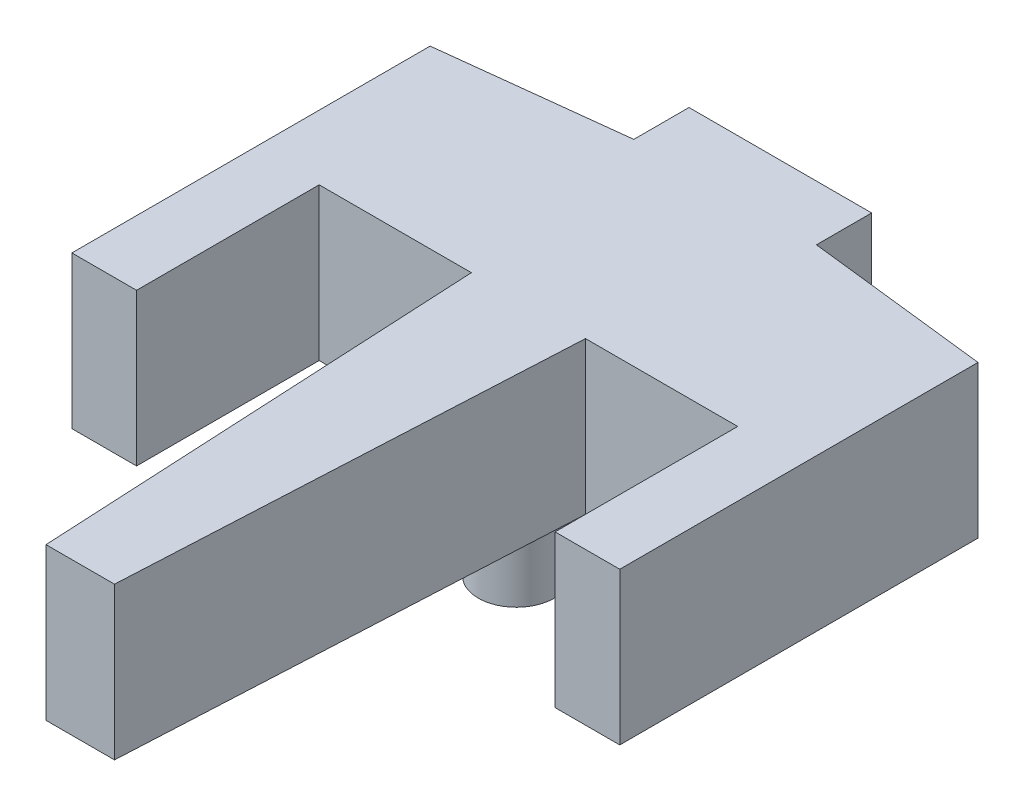
ISO-10303-21;
HEADER;
FILE_DESCRIPTION(('STEP AP214'),'2;1');
FILE_NAME('part.step','',(''),(''),'','','');
FILE_SCHEMA(('AUTOMOTIVE_DESIGN { 1 0 10303 214 1 1 1 1 }'));
ENDSEC;
DATA;
#1=APPLICATION_CONTEXT('core data for automotive mechanical design processes');
#2=APPLICATION_PROTOCOL_DEFINITION('international standard','automotive_design',2000,#1);
#3=PRODUCT_CONTEXT('',#1,'mechanical');
#4=PRODUCT('Part','Part','',(#3));
#5=PRODUCT_RELATED_PRODUCT_CATEGORY('part','',(#4));
#6=PRODUCT_DEFINITION_FORMATION('','',#4);
#7=PRODUCT_DEFINITION_CONTEXT('part definition',#1,'design');
#8=PRODUCT_DEFINITION('design','',#6,#7);
#9=PRODUCT_DEFINITION_SHAPE('','',#8);
#10=(LENGTH_UNIT() NAMED_UNIT(*) SI_UNIT(.MILLI.,.METRE.));
#11=(NAMED_UNIT(*) PLANE_ANGLE_UNIT() SI_UNIT($,.RADIAN.));
#12=(NAMED_UNIT(*) SI_UNIT($,.STERADIAN.) SOLID_ANGLE_UNIT());
#13=UNCERTAINTY_MEASURE_WITH_UNIT(LENGTH_MEASURE(1.E-05),#10,'distance_accuracy_value','');
#14=(GEOMETRIC_REPRESENTATION_CONTEXT(3) GLOBAL_UNCERTAINTY_ASSIGNED_CONTEXT((#13)) GLOBAL_UNIT_ASSIGNED_CONTEXT((#10,
#11,#12)) REPRESENTATION_CONTEXT('',''));
#15=CARTESIAN_POINT('',(0.,0.,0.));
#16=DIRECTION('',(0.,0.,1.));
#17=DIRECTION('',(1.,0.,0.));
#18=AXIS2_PLACEMENT_3D('',#15,#16,#17);
#19=CARTESIAN_POINT('',(21.2777137851973,10.,-44.4311292234106));
#20=DIRECTION('',(1.,0.,0.));
#21=DIRECTION('',(0.,0.,-1.));
#22=AXIS2_PLACEMENT_3D('',#19,#20,#21);
#23=PLANE('',#22);
#24=DIRECTION('',(0.,0.,1.));
#25=VECTOR('',#24,1.);
#26=CARTESIAN_POINT('',(21.2777137851973,0.,-44.4311292234106));
#27=LINE('',#26,#25);
#28=CARTESIAN_POINT('',(21.2777137851973,0.,-48.0578563263913));
#29=VERTEX_POINT('',#28);
#30=CARTESIAN_POINT('',(21.2777137851973,0.,-44.4311292234106));
#31=VERTEX_POINT('',#30);
#32=EDGE_CURVE('E177',#29,#31,#27,.T.);
#33=ORIENTED_EDGE('',*,*,#32,.T.);
#34=DIRECTION('',(0.,-1.,0.));
#35=VECTOR('',#34,1.);
#36=CARTESIAN_POINT('',(21.2777137851973,10.,-44.4311292234106));
#37=LINE('',#36,#35);
#38=CARTESIAN_POINT('',(21.2777137851973,10.,-44.4311292234106));
#39=VERTEX_POINT('',#38);
#40=EDGE_CURVE('E11',#39,#31,#37,.T.);
#41=ORIENTED_EDGE('',*,*,#40,.F.);
#42=DIRECTION('',(0.,0.,1.));
#43=VECTOR('',#42,1.);
#44=CARTESIAN_POINT('',(21.2777137851973,10.,-44.4311292234106));
#45=LINE('',#44,#43);
#46=CARTESIAN_POINT('',(21.2777137851973,10.,-48.0578563263913));
#47=VERTEX_POINT('',#46);
#48=EDGE_CURVE('E208',#47,#39,#45,.T.);
#49=ORIENTED_EDGE('',*,*,#48,.F.);
#50=DIRECTION('',(0.,-1.,0.));
#51=VECTOR('',#50,1.);
#52=CARTESIAN_POINT('',(21.2777137851973,10.,-48.0578563263913));
#53=LINE('',#52,#51);
#54=EDGE_CURVE('E173',#47,#29,#53,.T.);
#55=ORIENTED_EDGE('',*,*,#54,.T.);
#56=EDGE_LOOP('',(#33,#41,#49,#55));
#57=FACE_BOUND('',#56,.T.);
#58=ADVANCED_FACE('F33',(#57),#23,.F.);
#59=CARTESIAN_POINT('',(9.27771378519734,10.,-43.0465013141819));
#60=DIRECTION('',(0.114625131200818,0.,0.993408817807249));
#61=DIRECTION('',(0.993408817807249,0.,-0.114625131200818));
#62=AXIS2_PLACEMENT_3D('',#59,#60,#61);
#63=PLANE('',#62);
#64=DIRECTION('',(-0.993408817807249,0.,0.114625131200818));
#65=VECTOR('',#64,1.);
#66=CARTESIAN_POINT('',(9.27771378519734,0.,-43.0465013141819));
#67=LINE('',#66,#65);
#68=CARTESIAN_POINT('',(9.27771378519734,0.,-43.0465013141819));
#69=VERTEX_POINT('',#68);
#70=EDGE_CURVE('E180',#31,#69,#67,.T.);
#71=ORIENTED_EDGE('',*,*,#70,.T.);
#72=DIRECTION('',(0.,-1.,0.));
#73=VECTOR('',#72,1.);
#74=CARTESIAN_POINT('',(9.27771378519734,10.,-43.0465013141819));
#75=LINE('',#74,#73);
#76=CARTESIAN_POINT('',(9.27771378519734,10.,-43.0465013141819));
#77=VERTEX_POINT('',#76);
#78=EDGE_CURVE('E41',#77,#69,#75,.T.);
#79=ORIENTED_EDGE('',*,*,#78,.F.);
#80=DIRECTION('',(-0.993408817807249,0.,0.114625131200818));
#81=VECTOR('',#80,1.);
#82=CARTESIAN_POINT('',(9.27771378519734,10.,-43.0465013141819));
#83=LINE('',#82,#81);
#84=EDGE_CURVE('E116',#39,#77,#83,.T.);
#85=ORIENTED_EDGE('',*,*,#84,.F.);
#86=ORIENTED_EDGE('',*,*,#40,.T.);
#87=EDGE_LOOP('',(#71,#79,#85,#86));
#88=FACE_BOUND('',#87,.T.);
#89=ADVANCED_FACE('F306',(#88),#63,.F.);
#90=CARTESIAN_POINT('',(9.27771378519734,10.,-19.507826857294));
#91=DIRECTION('',(1.,0.,0.));
#92=DIRECTION('',(0.,0.,-1.));
#93=AXIS2_PLACEMENT_3D('',#90,#91,#92);
#94=PLANE('',#93);
#95=DIRECTION('',(0.,0.,1.));
#96=VECTOR('',#95,1.);
#97=CARTESIAN_POINT('',(9.27771378519734,0.,-19.507826857294));
#98=LINE('',#97,#96);
#99=CARTESIAN_POINT('',(9.27771378519734,0.,-19.507826857294));
#100=VERTEX_POINT('',#99);
#101=EDGE_CURVE('E183',#69,#100,#98,.T.);
#102=ORIENTED_EDGE('',*,*,#101,.T.);
#103=DIRECTION('',(0.,-1.,0.));
#104=VECTOR('',#103,1.);
#105=CARTESIAN_POINT('',(9.27771378519734,10.,-19.507826857294));
#106=LINE('',#105,#104);
#107=CARTESIAN_POINT('',(9.27771378519734,10.,-19.507826857294));
#108=VERTEX_POINT('',#107);
#109=EDGE_CURVE('E239',#108,#100,#106,.T.);
#110=ORIENTED_EDGE('',*,*,#109,.F.);
#111=DIRECTION('',(0.,0.,1.));
#112=VECTOR('',#111,1.);
#113=CARTESIAN_POINT('',(9.27771378519734,10.,-19.507826857294));
#114=LINE('',#113,#112);
#115=EDGE_CURVE('E247',#77,#108,#114,.T.);
#116=ORIENTED_EDGE('',*,*,#115,.F.);
#117=ORIENTED_EDGE('',*,*,#78,.T.);
#118=EDGE_LOOP('',(#102,#110,#116,#117));
#119=FACE_BOUND('',#118,.T.);
#120=ADVANCED_FACE('F245',(#119),#94,.F.);
#121=CARTESIAN_POINT('',(13.5277137851973,10.,-19.507826857294));
#122=DIRECTION('',(0.,0.,-1.));
#123=DIRECTION('',(-1.,0.,0.));
#124=AXIS2_PLACEMENT_3D('',#121,#122,#123);
#125=PLANE('',#124);
#126=DIRECTION('',(1.,0.,0.));
#127=VECTOR('',#126,1.);
#128=CARTESIAN_POINT('',(13.5277137851973,0.,-19.507826857294));
#129=LINE('',#128,#127);
#130=CARTESIAN_POINT('',(13.5277137851973,0.,-19.507826857294));
#131=VERTEX_POINT('',#130);
#132=EDGE_CURVE('E185',#100,#131,#129,.T.);
#133=ORIENTED_EDGE('',*,*,#132,.T.);
#134=DIRECTION('',(0.,-1.,0.));
#135=VECTOR('',#134,1.);
#136=CARTESIAN_POINT('',(13.5277137851973,10.,-19.507826857294));
#137=LINE('',#136,#135);
#138=CARTESIAN_POINT('',(13.5277137851973,10.,-19.507826857294));
#139=VERTEX_POINT('',#138);
#140=EDGE_CURVE('E236',#139,#131,#137,.T.);
#141=ORIENTED_EDGE('',*,*,#140,.F.);
#142=DIRECTION('',(1.,0.,0.));
#143=VECTOR('',#142,1.);
#144=CARTESIAN_POINT('',(13.5277137851973,10.,-19.507826857294));
#145=LINE('',#144,#143);
#146=EDGE_CURVE('E265',#108,#139,#145,.T.);
#147=ORIENTED_EDGE('',*,*,#146,.F.);
#148=ORIENTED_EDGE('',*,*,#109,.T.);
#149=EDGE_LOOP('',(#133,#141,#147,#148));
#150=FACE_BOUND('',#149,.T.);
#151=ADVANCED_FACE('F256',(#150),#125,.F.);
#152=CARTESIAN_POINT('',(13.5277137851973,10.,-31.507826857294));
#153=DIRECTION('',(-1.,0.,0.));
#154=DIRECTION('',(0.,0.,1.));
#155=AXIS2_PLACEMENT_3D('',#152,#153,#154);
#156=PLANE('',#155);
#157=DIRECTION('',(0.,0.,-1.));
#158=VECTOR('',#157,1.);
#159=CARTESIAN_POINT('',(13.5277137851973,0.,-31.507826857294));
#160=LINE('',#159,#158);
#161=CARTESIAN_POINT('',(13.5277137851973,0.,-31.507826857294));
#162=VERTEX_POINT('',#161);
#163=EDGE_CURVE('E187',#131,#162,#160,.T.);
#164=ORIENTED_EDGE('',*,*,#163,.T.);
#165=DIRECTION('',(0.,-1.,0.));
#166=VECTOR('',#165,1.);
#167=CARTESIAN_POINT('',(13.5277137851973,10.,-31.507826857294));
#168=LINE('',#167,#166);
#169=CARTESIAN_POINT('',(13.5277137851973,10.,-31.507826857294));
#170=VERTEX_POINT('',#169);
#171=EDGE_CURVE('E233',#170,#162,#168,.T.);
#172=ORIENTED_EDGE('',*,*,#171,.F.);
#173=DIRECTION('',(0.,0.,-1.));
#174=VECTOR('',#173,1.);
#175=CARTESIAN_POINT('',(13.5277137851973,10.,-31.507826857294));
#176=LINE('',#175,#174);
#177=EDGE_CURVE('E262',#139,#170,#176,.T.);
#178=ORIENTED_EDGE('',*,*,#177,.F.);
#179=ORIENTED_EDGE('',*,*,#140,.T.);
#180=EDGE_LOOP('',(#164,#172,#178,#179));
#181=FACE_BOUND('',#180,.T.);
#182=ADVANCED_FACE('F260',(#181),#156,.F.);
#183=CARTESIAN_POINT('',(23.5277137851973,10.,-31.507826857294));
#184=DIRECTION('',(0.,0.,-1.));
#185=DIRECTION('',(-1.,0.,0.));
#186=AXIS2_PLACEMENT_3D('',#183,#184,#185);
#187=PLANE('',#186);
#188=DIRECTION('',(1.,0.,0.));
#189=VECTOR('',#188,1.);
#190=CARTESIAN_POINT('',(23.5277137851973,0.,-31.507826857294));
#191=LINE('',#190,#189);
#192=CARTESIAN_POINT('',(23.5277137851973,0.,-31.507826857294));
#193=VERTEX_POINT('',#192);
#194=EDGE_CURVE('E189',#162,#193,#191,.T.);
#195=ORIENTED_EDGE('',*,*,#194,.T.);
#196=DIRECTION('',(0.,-1.,0.));
#197=VECTOR('',#196,1.);
#198=CARTESIAN_POINT('',(23.5277137851973,10.,-31.507826857294));
#199=LINE('',#198,#197);
#200=CARTESIAN_POINT('',(23.5277137851973,10.,-31.507826857294));
#201=VERTEX_POINT('',#200);
#202=EDGE_CURVE('E230',#201,#193,#199,.T.);
#203=ORIENTED_EDGE('',*,*,#202,.F.);
#204=DIRECTION('',(1.,0.,0.));
#205=VECTOR('',#204,1.);
#206=CARTESIAN_POINT('',(23.5277137851973,10.,-31.507826857294));
#207=LINE('',#206,#205);
#208=EDGE_CURVE('E264',#170,#201,#207,.T.);
#209=ORIENTED_EDGE('',*,*,#208,.F.);
#210=ORIENTED_EDGE('',*,*,#171,.T.);
#211=EDGE_LOOP('',(#195,#203,#209,#210));
#212=FACE_BOUND('',#211,.T.);
#213=ADVANCED_FACE('F319',(#212),#187,.F.);
#214=CARTESIAN_POINT('',(25.0277137851973,10.,-2.05785632639129));
#215=DIRECTION('',(0.998705390489217,0.,-0.0508678976151054));
#216=DIRECTION('',(-0.0508678976151054,0.,-0.998705390489217));
#217=AXIS2_PLACEMENT_3D('',#214,#215,#216);
#218=PLANE('',#217);
#219=DIRECTION('',(0.0508678976151054,0.,0.998705390489217));
#220=VECTOR('',#219,1.);
#221=CARTESIAN_POINT('',(25.0277137851973,0.,-2.05785632639129));
#222=LINE('',#221,#220);
#223=CARTESIAN_POINT('',(25.0277137851973,0.,-2.05785632639129));
#224=VERTEX_POINT('',#223);
#225=EDGE_CURVE('E191',#193,#224,#222,.T.);
#226=ORIENTED_EDGE('',*,*,#225,.T.);
#227=DIRECTION('',(0.,-1.,0.));
#228=VECTOR('',#227,1.);
#229=CARTESIAN_POINT('',(25.0277137851973,10.,-2.05785632639129));
#230=LINE('',#229,#228);
#231=CARTESIAN_POINT('',(25.0277137851973,10.,-2.05785632639129));
#232=VERTEX_POINT('',#231);
#233=EDGE_CURVE('E227',#232,#224,#230,.T.);
#234=ORIENTED_EDGE('',*,*,#233,.F.);
#235=DIRECTION('',(0.0508678976151054,0.,0.998705390489217));
#236=VECTOR('',#235,1.);
#237=CARTESIAN_POINT('',(25.0277137851973,10.,-2.05785632639129));
#238=LINE('',#237,#236);
#239=EDGE_CURVE('E267',#201,#232,#238,.T.);
#240=ORIENTED_EDGE('',*,*,#239,.F.);
#241=ORIENTED_EDGE('',*,*,#202,.T.);
#242=EDGE_LOOP('',(#226,#234,#240,#241));
#243=FACE_BOUND('',#242,.T.);
#244=ADVANCED_FACE('F322',(#243),#218,.F.);
#245=CARTESIAN_POINT('',(29.5277137851973,10.,-2.05785632639129));
#246=DIRECTION('',(0.,0.,-1.));
#247=DIRECTION('',(-1.,0.,0.));
#248=AXIS2_PLACEMENT_3D('',#245,#246,#247);
#249=PLANE('',#248);
#250=DIRECTION('',(1.,0.,0.));
#251=VECTOR('',#250,1.);
#252=CARTESIAN_POINT('',(29.5277137851973,0.,-2.05785632639129));
#253=LINE('',#252,#251);
#254=CARTESIAN_POINT('',(29.5277137851973,0.,-2.05785632639129));
#255=VERTEX_POINT('',#254);
#256=EDGE_CURVE('E193',#224,#255,#253,.T.);
#257=ORIENTED_EDGE('',*,*,#256,.T.);
#258=DIRECTION('',(0.,-1.,0.));
#259=VECTOR('',#258,1.);
#260=CARTESIAN_POINT('',(29.5277137851973,10.,-2.05785632639129));
#261=LINE('',#260,#259);
#262=CARTESIAN_POINT('',(29.5277137851973,10.,-2.05785632639129));
#263=VERTEX_POINT('',#262);
#264=EDGE_CURVE('E224',#263,#255,#261,.T.);
#265=ORIENTED_EDGE('',*,*,#264,.F.);
#266=DIRECTION('',(1.,0.,0.));
#267=VECTOR('',#266,1.);
#268=CARTESIAN_POINT('',(29.5277137851973,10.,-2.05785632639129));
#269=LINE('',#268,#267);
#270=EDGE_CURVE('E273',#232,#263,#269,.T.);
#271=ORIENTED_EDGE('',*,*,#270,.F.);
#272=ORIENTED_EDGE('',*,*,#233,.T.);
#273=EDGE_LOOP('',(#257,#265,#271,#272));
#274=FACE_BOUND('',#273,.T.);
#275=ADVANCED_FACE('F326',(#274),#249,.F.);
#276=CARTESIAN_POINT('',(31.0277137851973,10.,-31.507826857294));
#277=DIRECTION('',(-0.998705390489217,0.,-0.0508678976151053));
#278=DIRECTION('',(-0.0508678976151053,0.,0.998705390489217));
#279=AXIS2_PLACEMENT_3D('',#276,#277,#278);
#280=PLANE('',#279);
#281=DIRECTION('',(0.0508678976151053,0.,-0.998705390489217));
#282=VECTOR('',#281,1.);
#283=CARTESIAN_POINT('',(31.0277137851973,0.,-31.507826857294));
#284=LINE('',#283,#282);
#285=CARTESIAN_POINT('',(31.0277137851973,0.,-31.507826857294));
#286=VERTEX_POINT('',#285);
#287=EDGE_CURVE('E195',#255,#286,#284,.T.);
#288=ORIENTED_EDGE('',*,*,#287,.T.);
#289=DIRECTION('',(0.,-1.,0.));
#290=VECTOR('',#289,1.);
#291=CARTESIAN_POINT('',(31.0277137851973,10.,-31.507826857294));
#292=LINE('',#291,#290);
#293=CARTESIAN_POINT('',(31.0277137851973,10.,-31.507826857294));
#294=VERTEX_POINT('',#293);
#295=EDGE_CURVE('E221',#294,#286,#292,.T.);
#296=ORIENTED_EDGE('',*,*,#295,.F.);
#297=DIRECTION('',(0.0508678976151053,0.,-0.998705390489217));
#298=VECTOR('',#297,1.);
#299=CARTESIAN_POINT('',(31.0277137851973,10.,-31.507826857294));
#300=LINE('',#299,#298);
#301=EDGE_CURVE('E275',#263,#294,#300,.T.);
#302=ORIENTED_EDGE('',*,*,#301,.F.);
#303=ORIENTED_EDGE('',*,*,#264,.T.);
#304=EDGE_LOOP('',(#288,#296,#302,#303));
#305=FACE_BOUND('',#304,.T.);
#306=ADVANCED_FACE('F330',(#305),#280,.F.);
#307=CARTESIAN_POINT('',(41.0277137851973,10.,-31.507826857294));
#308=DIRECTION('',(0.,0.,-1.));
#309=DIRECTION('',(-1.,0.,0.));
#310=AXIS2_PLACEMENT_3D('',#307,#308,#309);
#311=PLANE('',#310);
#312=DIRECTION('',(1.,0.,0.));
#313=VECTOR('',#312,1.);
#314=CARTESIAN_POINT('',(41.0277137851973,0.,-31.507826857294));
#315=LINE('',#314,#313);
#316=CARTESIAN_POINT('',(41.0277137851973,0.,-31.507826857294));
#317=VERTEX_POINT('',#316);
#318=EDGE_CURVE('E197',#286,#317,#315,.T.);
#319=ORIENTED_EDGE('',*,*,#318,.T.);
#320=DIRECTION('',(0.,-1.,0.));
#321=VECTOR('',#320,1.);
#322=CARTESIAN_POINT('',(41.0277137851973,10.,-31.507826857294));
#323=LINE('',#322,#321);
#324=CARTESIAN_POINT('',(41.0277137851973,10.,-31.507826857294));
#325=VERTEX_POINT('',#324);
#326=EDGE_CURVE('E218',#325,#317,#323,.T.);
#327=ORIENTED_EDGE('',*,*,#326,.F.);
#328=DIRECTION('',(1.,0.,0.));
#329=VECTOR('',#328,1.);
#330=CARTESIAN_POINT('',(41.0277137851973,10.,-31.507826857294));
#331=LINE('',#330,#329);
#332=EDGE_CURVE('E277',#294,#325,#331,.T.);
#333=ORIENTED_EDGE('',*,*,#332,.F.);
#334=ORIENTED_EDGE('',*,*,#295,.T.);
#335=EDGE_LOOP('',(#319,#327,#333,#334));
#336=FACE_BOUND('',#335,.T.);
#337=ADVANCED_FACE('F334',(#336),#311,.F.);
#338=CARTESIAN_POINT('',(41.0277137851973,10.,-19.507826857294));
#339=DIRECTION('',(1.,0.,0.));
#340=DIRECTION('',(0.,0.,-1.));
#341=AXIS2_PLACEMENT_3D('',#338,#339,#340);
#342=PLANE('',#341);
#343=DIRECTION('',(0.,0.,1.));
#344=VECTOR('',#343,1.);
#345=CARTESIAN_POINT('',(41.0277137851973,0.,-19.507826857294));
#346=LINE('',#345,#344);
#347=CARTESIAN_POINT('',(41.0277137851973,0.,-19.507826857294));
#348=VERTEX_POINT('',#347);
#349=EDGE_CURVE('E199',#317,#348,#346,.T.);
#350=ORIENTED_EDGE('',*,*,#349,.T.);
#351=DIRECTION('',(0.,-1.,0.));
#352=VECTOR('',#351,1.);
#353=CARTESIAN_POINT('',(41.0277137851973,10.,-19.507826857294));
#354=LINE('',#353,#352);
#355=CARTESIAN_POINT('',(41.0277137851973,10.,-19.507826857294));
#356=VERTEX_POINT('',#355);
#357=EDGE_CURVE('E215',#356,#348,#354,.T.);
#358=ORIENTED_EDGE('',*,*,#357,.F.);
#359=DIRECTION('',(0.,0.,1.));
#360=VECTOR('',#359,1.);
#361=CARTESIAN_POINT('',(41.0277137851973,10.,-19.507826857294));
#362=LINE('',#361,#360);
#363=EDGE_CURVE('E279',#325,#356,#362,.T.);
#364=ORIENTED_EDGE('',*,*,#363,.F.);
#365=ORIENTED_EDGE('',*,*,#326,.T.);
#366=EDGE_LOOP('',(#350,#358,#364,#365));
#367=FACE_BOUND('',#366,.T.);
#368=ADVANCED_FACE('F338',(#367),#342,.F.);
#369=CARTESIAN_POINT('',(45.2777137851973,10.,-19.507826857294));
#370=DIRECTION('',(0.,0.,-1.));
#371=DIRECTION('',(-1.,0.,0.));
#372=AXIS2_PLACEMENT_3D('',#369,#370,#371);
#373=PLANE('',#372);
#374=DIRECTION('',(1.,0.,0.));
#375=VECTOR('',#374,1.);
#376=CARTESIAN_POINT('',(45.2777137851973,0.,-19.507826857294));
#377=LINE('',#376,#375);
#378=CARTESIAN_POINT('',(45.2777137851973,0.,-19.507826857294));
#379=VERTEX_POINT('',#378);
#380=EDGE_CURVE('E201',#348,#379,#377,.T.);
#381=ORIENTED_EDGE('',*,*,#380,.T.);
#382=DIRECTION('',(0.,-1.,0.));
#383=VECTOR('',#382,1.);
#384=CARTESIAN_POINT('',(45.2777137851973,10.,-19.507826857294));
#385=LINE('',#384,#383);
#386=CARTESIAN_POINT('',(45.2777137851973,10.,-19.507826857294));
#387=VERTEX_POINT('',#386);
#388=EDGE_CURVE('E212',#387,#379,#385,.T.);
#389=ORIENTED_EDGE('',*,*,#388,.F.);
#390=DIRECTION('',(1.,0.,0.));
#391=VECTOR('',#390,1.);
#392=CARTESIAN_POINT('',(45.2777137851973,10.,-19.507826857294));
#393=LINE('',#392,#391);
#394=EDGE_CURVE('E281',#356,#387,#393,.T.);
#395=ORIENTED_EDGE('',*,*,#394,.F.);
#396=ORIENTED_EDGE('',*,*,#357,.T.);
#397=EDGE_LOOP('',(#381,#389,#395,#396));
#398=FACE_BOUND('',#397,.T.);
#399=ADVANCED_FACE('F287',(#398),#373,.F.);
#400=CARTESIAN_POINT('',(45.2777137851973,10.,-43.0465013141819));
#401=DIRECTION('',(-1.,0.,0.));
#402=DIRECTION('',(0.,0.,1.));
#403=AXIS2_PLACEMENT_3D('',#400,#401,#402);
#404=PLANE('',#403);
#405=DIRECTION('',(0.,0.,-1.));
#406=VECTOR('',#405,1.);
#407=CARTESIAN_POINT('',(45.2777137851973,0.,-43.0465013141819));
#408=LINE('',#407,#406);
#409=CARTESIAN_POINT('',(45.2777137851973,0.,-43.0465013141819));
#410=VERTEX_POINT('',#409);
#411=EDGE_CURVE('E203',#379,#410,#408,.T.);
#412=ORIENTED_EDGE('',*,*,#411,.T.);
#413=DIRECTION('',(0.,-1.,0.));
#414=VECTOR('',#413,1.);
#415=CARTESIAN_POINT('',(45.2777137851973,10.,-43.0465013141819));
#416=LINE('',#415,#414);
#417=CARTESIAN_POINT('',(45.2777137851973,10.,-43.0465013141819));
#418=VERTEX_POINT('',#417);
#419=EDGE_CURVE('E168',#418,#410,#416,.T.);
#420=ORIENTED_EDGE('',*,*,#419,.F.);
#421=DIRECTION('',(0.,0.,-1.));
#422=VECTOR('',#421,1.);
#423=CARTESIAN_POINT('',(45.2777137851973,10.,-43.0465013141819));
#424=LINE('',#423,#422);
#425=EDGE_CURVE('E159',#387,#418,#424,.T.);
#426=ORIENTED_EDGE('',*,*,#425,.F.);
#427=ORIENTED_EDGE('',*,*,#388,.T.);
#428=EDGE_LOOP('',(#412,#420,#426,#427));
#429=FACE_BOUND('',#428,.T.);
#430=ADVANCED_FACE('F291',(#429),#404,.F.);
#431=CARTESIAN_POINT('',(33.2777137851973,10.,-44.4311292234106));
#432=DIRECTION('',(-0.114625131200815,0.,0.993408817807249));
#433=DIRECTION('',(0.993408817807249,0.,0.114625131200815));
#434=AXIS2_PLACEMENT_3D('',#431,#432,#433);
#435=PLANE('',#434);
#436=DIRECTION('',(-0.993408817807249,0.,-0.114625131200815));
#437=VECTOR('',#436,1.);
#438=CARTESIAN_POINT('',(33.2777137851973,0.,-44.4311292234106));
#439=LINE('',#438,#437);
#440=CARTESIAN_POINT('',(33.2777137851973,0.,-44.4311292234106));
#441=VERTEX_POINT('',#440);
#442=EDGE_CURVE('E167',#410,#441,#439,.T.);
#443=ORIENTED_EDGE('',*,*,#442,.T.);
#444=DIRECTION('',(0.,-1.,0.));
#445=VECTOR('',#444,1.);
#446=CARTESIAN_POINT('',(33.2777137851973,10.,-44.4311292234106));
#447=LINE('',#446,#445);
#448=CARTESIAN_POINT('',(33.2777137851973,10.,-44.4311292234106));
#449=VERTEX_POINT('',#448);
#450=EDGE_CURVE('E164',#449,#441,#447,.T.);
#451=ORIENTED_EDGE('',*,*,#450,.F.);
#452=DIRECTION('',(-0.993408817807249,0.,-0.114625131200815));
#453=VECTOR('',#452,1.);
#454=CARTESIAN_POINT('',(33.2777137851973,10.,-44.4311292234106));
#455=LINE('',#454,#453);
#456=EDGE_CURVE('E153',#418,#449,#455,.T.);
#457=ORIENTED_EDGE('',*,*,#456,.F.);
#458=ORIENTED_EDGE('',*,*,#419,.T.);
#459=EDGE_LOOP('',(#443,#451,#457,#458));
#460=FACE_BOUND('',#459,.T.);
#461=ADVANCED_FACE('F165',(#460),#435,.F.);
#462=CARTESIAN_POINT('',(33.2777137851973,10.,-48.0578563263913));
#463=DIRECTION('',(-1.,0.,0.));
#464=DIRECTION('',(0.,0.,1.));
#465=AXIS2_PLACEMENT_3D('',#462,#463,#464);
#466=PLANE('',#465);
#467=DIRECTION('',(0.,0.,-1.));
#468=VECTOR('',#467,1.);
#469=CARTESIAN_POINT('',(33.2777137851973,0.,-48.0578563263913));
#470=LINE('',#469,#468);
#471=CARTESIAN_POINT('',(33.2777137851973,0.,-48.0578563263913));
#472=VERTEX_POINT('',#471);
#473=EDGE_CURVE('E102',#441,#472,#470,.T.);
#474=ORIENTED_EDGE('',*,*,#473,.T.);
#475=DIRECTION('',(0.,-1.,0.));
#476=VECTOR('',#475,1.);
#477=CARTESIAN_POINT('',(33.2777137851973,10.,-48.0578563263913));
#478=LINE('',#477,#476);
#479=CARTESIAN_POINT('',(33.2777137851973,10.,-48.0578563263913));
#480=VERTEX_POINT('',#479);
#481=EDGE_CURVE('E169',#480,#472,#478,.T.);
#482=ORIENTED_EDGE('',*,*,#481,.F.);
#483=DIRECTION('',(0.,0.,-1.));
#484=VECTOR('',#483,1.);
#485=CARTESIAN_POINT('',(33.2777137851973,10.,-48.0578563263913));
#486=LINE('',#485,#484);
#487=EDGE_CURVE('E157',#449,#480,#486,.T.);
#488=ORIENTED_EDGE('',*,*,#487,.F.);
#489=ORIENTED_EDGE('',*,*,#450,.T.);
#490=EDGE_LOOP('',(#474,#482,#488,#489));
#491=FACE_BOUND('',#490,.T.);
#492=ADVANCED_FACE('F171',(#491),#466,.F.);
#493=CARTESIAN_POINT('',(21.2777137851973,10.,-48.0578563263913));
#494=DIRECTION('',(0.,0.,1.));
#495=DIRECTION('',(1.,0.,0.));
#496=AXIS2_PLACEMENT_3D('',#493,#494,#495);
#497=PLANE('',#496);
#498=DIRECTION('',(-1.,0.,0.));
#499=VECTOR('',#498,1.);
#500=CARTESIAN_POINT('',(21.2777137851973,0.,-48.0578563263913));
#501=LINE('',#500,#499);
#502=EDGE_CURVE('E108',#472,#29,#501,.T.);
#503=ORIENTED_EDGE('',*,*,#502,.T.);
#504=ORIENTED_EDGE('',*,*,#54,.F.);
#505=DIRECTION('',(-1.,0.,0.));
#506=VECTOR('',#505,1.);
#507=CARTESIAN_POINT('',(21.2777137851973,10.,-48.0578563263913));
#508=LINE('',#507,#506);
#509=EDGE_CURVE('E49',#480,#47,#508,.T.);
#510=ORIENTED_EDGE('',*,*,#509,.F.);
#511=ORIENTED_EDGE('',*,*,#481,.T.);
#512=EDGE_LOOP('',(#503,#504,#510,#511));
#513=FACE_BOUND('',#512,.T.);
#514=ADVANCED_FACE('F295',(#513),#497,.F.);
#515=CARTESIAN_POINT('',(0.,10.,0.));
#516=DIRECTION('',(0.,-1.,0.));
#517=DIRECTION('',(0.,0.,-1.));
#518=AXIS2_PLACEMENT_3D('',#515,#516,#517);
#519=PLANE('',#518);
#520=ORIENTED_EDGE('',*,*,#48,.T.);
#521=ORIENTED_EDGE('',*,*,#84,.T.);
#522=ORIENTED_EDGE('',*,*,#115,.T.);
#523=ORIENTED_EDGE('',*,*,#146,.T.);
#524=ORIENTED_EDGE('',*,*,#177,.T.);
#525=ORIENTED_EDGE('',*,*,#208,.T.);
#526=ORIENTED_EDGE('',*,*,#239,.T.);
#527=ORIENTED_EDGE('',*,*,#270,.T.);
#528=ORIENTED_EDGE('',*,*,#301,.T.);
#529=ORIENTED_EDGE('',*,*,#332,.T.);
#530=ORIENTED_EDGE('',*,*,#363,.T.);
#531=ORIENTED_EDGE('',*,*,#394,.T.);
#532=ORIENTED_EDGE('',*,*,#425,.T.);
#533=ORIENTED_EDGE('',*,*,#456,.T.);
#534=ORIENTED_EDGE('',*,*,#487,.T.);
#535=ORIENTED_EDGE('',*,*,#509,.T.);
#536=EDGE_LOOP('',(#520,#521,#522,#523,#524,#525,#526,#527,#528,#529,#530,#531,#532,#533,#534,#535));
#537=FACE_BOUND('',#536,.T.);
#538=ADVANCED_FACE('F155',(#537),#519,.F.);
#539=CARTESIAN_POINT('',(0.,0.,0.));
#540=DIRECTION('',(0.,-1.,0.));
#541=DIRECTION('',(0.,0.,-1.));
#542=AXIS2_PLACEMENT_3D('',#539,#540,#541);
#543=PLANE('',#542);
#544=CARTESIAN_POINT('',(27.2777137851973,0.,-30.7119345368713));
#545=DIRECTION('',(0.,-1.,0.));
#546=DIRECTION('',(0.,0.,-1.));
#547=AXIS2_PLACEMENT_3D('',#544,#545,#546);
#548=CIRCLE('',#547,2.5);
#549=CARTESIAN_POINT('',(27.2777137851973,0.,-33.2119345368713));
#550=VERTEX_POINT('',#549);
#551=EDGE_CURVE('E400',#550,#550,#548,.T.);
#552=ORIENTED_EDGE('',*,*,#551,.F.);
#553=EDGE_LOOP('',(#552));
#554=FACE_BOUND('',#553,.T.);
#555=ORIENTED_EDGE('',*,*,#32,.F.);
#556=ORIENTED_EDGE('',*,*,#502,.F.);
#557=ORIENTED_EDGE('',*,*,#473,.F.);
#558=ORIENTED_EDGE('',*,*,#442,.F.);
#559=ORIENTED_EDGE('',*,*,#411,.F.);
#560=ORIENTED_EDGE('',*,*,#380,.F.);
#561=ORIENTED_EDGE('',*,*,#349,.F.);
#562=ORIENTED_EDGE('',*,*,#318,.F.);
#563=ORIENTED_EDGE('',*,*,#287,.F.);
#564=ORIENTED_EDGE('',*,*,#256,.F.);
#565=ORIENTED_EDGE('',*,*,#225,.F.);
#566=ORIENTED_EDGE('',*,*,#194,.F.);
#567=ORIENTED_EDGE('',*,*,#163,.F.);
#568=ORIENTED_EDGE('',*,*,#132,.F.);
#569=ORIENTED_EDGE('',*,*,#101,.F.);
#570=ORIENTED_EDGE('',*,*,#70,.F.);
#571=EDGE_LOOP('',(#555,#556,#557,#558,#559,#560,#561,#562,#563,#564,#565,#566,#567,#568,#569,#570));
#572=FACE_BOUND('',#571,.T.);
#573=ADVANCED_FACE('F251',(#554,#572),#543,.T.);
#574=CARTESIAN_POINT('',(27.2777137851973,-5.,-30.7119345368713));
#575=DIRECTION('',(0.,1.,0.));
#576=DIRECTION('',(0.,0.,1.));
#577=AXIS2_PLACEMENT_3D('',#574,#575,#576);
#578=CYLINDRICAL_SURFACE('',#577,2.5);
#579=CARTESIAN_POINT('',(27.2777137851973,-5.,-30.7119345368713));
#580=DIRECTION('',(0.,-1.,0.));
#581=DIRECTION('',(0.,0.,-1.));
#582=AXIS2_PLACEMENT_3D('',#579,#580,#581);
#583=CIRCLE('',#582,2.5);
#584=CARTESIAN_POINT('',(27.2777137851973,-5.,-33.2119345368713));
#585=VERTEX_POINT('',#584);
#586=EDGE_CURVE('E181',#585,#585,#583,.T.);
#587=ORIENTED_EDGE('',*,*,#586,.F.);
#588=EDGE_LOOP('',(#587));
#589=FACE_BOUND('',#588,.T.);
#590=ORIENTED_EDGE('',*,*,#551,.T.);
#591=EDGE_LOOP('',(#590));
#592=FACE_BOUND('',#591,.T.);
#593=ADVANCED_FACE('F375',(#589,#592),#578,.T.);
#594=CARTESIAN_POINT('',(27.2777137851973,-5.,-30.7119345368713));
#595=DIRECTION('',(0.,-1.,0.));
#596=DIRECTION('',(0.,0.,-1.));
#597=AXIS2_PLACEMENT_3D('',#594,#595,#596);
#598=PLANE('',#597);
#599=ORIENTED_EDGE('',*,*,#586,.T.);
#600=EDGE_LOOP('',(#599));
#601=FACE_BOUND('',#600,.T.);
#602=ADVANCED_FACE('F384',(#601),#598,.T.);
#603=CLOSED_SHELL('',(#58,#89,#120,#151,#182,#213,#244,#275,#306,#337,#368,#399,#430,#461,#492,
#514,#538,#573,#593,#602));
#604=MANIFOLD_SOLID_BREP('B2',#603);
#605=ADVANCED_BREP_SHAPE_REPRESENTATION('',(#18,#604),#14);
#606=SHAPE_DEFINITION_REPRESENTATION(#9,#605);
ENDSEC;
END-ISO-10303-21;
